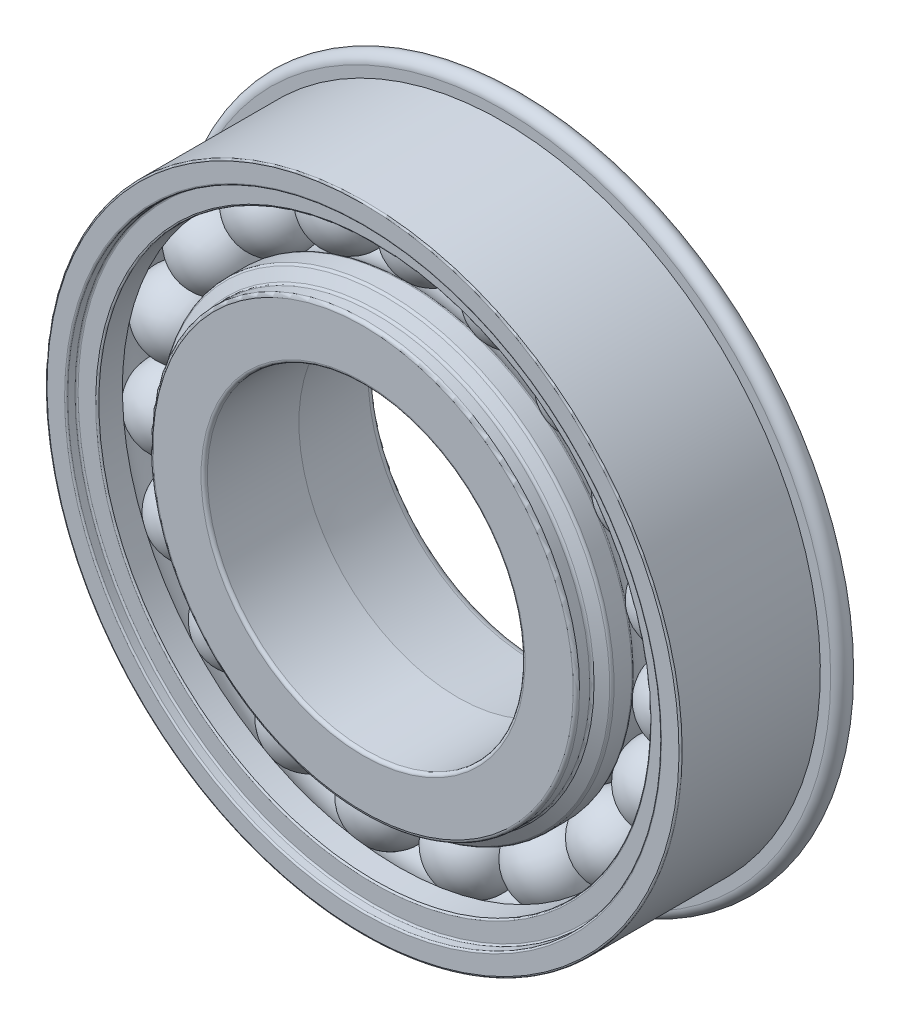
ISO-10303-21;
HEADER;
FILE_DESCRIPTION(('STEP AP214'),'2;1');
FILE_NAME('part.step','',(''),(''),'','','');
FILE_SCHEMA(('AUTOMOTIVE_DESIGN { 1 0 10303 214 1 1 1 1 }'));
ENDSEC;
DATA;
#1=APPLICATION_CONTEXT('core data for automotive mechanical design processes');
#2=APPLICATION_PROTOCOL_DEFINITION('international standard','automotive_design',2000,#1);
#3=PRODUCT_CONTEXT('',#1,'mechanical');
#4=PRODUCT('Part','Part','',(#3));
#5=PRODUCT_RELATED_PRODUCT_CATEGORY('part','',(#4));
#6=PRODUCT_DEFINITION_FORMATION('','',#4);
#7=PRODUCT_DEFINITION_CONTEXT('part definition',#1,'design');
#8=PRODUCT_DEFINITION('design','',#6,#7);
#9=PRODUCT_DEFINITION_SHAPE('','',#8);
#10=(LENGTH_UNIT() NAMED_UNIT(*) SI_UNIT(.MILLI.,.METRE.));
#11=(NAMED_UNIT(*) PLANE_ANGLE_UNIT() SI_UNIT($,.RADIAN.));
#12=(NAMED_UNIT(*) SI_UNIT($,.STERADIAN.) SOLID_ANGLE_UNIT());
#13=UNCERTAINTY_MEASURE_WITH_UNIT(LENGTH_MEASURE(1.E-05),#10,'distance_accuracy_value','');
#14=(GEOMETRIC_REPRESENTATION_CONTEXT(3) GLOBAL_UNCERTAINTY_ASSIGNED_CONTEXT((#13)) GLOBAL_UNIT_ASSIGNED_CONTEXT((#10,
#11,#12)) REPRESENTATION_CONTEXT('',''));
#15=CARTESIAN_POINT('',(0.,0.,0.));
#16=DIRECTION('',(0.,0.,1.));
#17=DIRECTION('',(1.,0.,0.));
#18=AXIS2_PLACEMENT_3D('',#15,#16,#17);
#19=CARTESIAN_POINT('',(-6.65562477986349,19.3871726569314,1.5621));
#20=DIRECTION('',(-0.32469946920467,0.945817241700639,0.));
#21=DIRECTION('',(0.,0.,-1.));
#22=AXIS2_PLACEMENT_3D('',#19,#20,#21);
#23=SPHERICAL_SURFACE('',#22,3.175);
#24=CARTESIAN_POINT('',(-7.68654559458832,22.3901423993309,1.5621));
#25=VERTEX_POINT('',#24);
#26=VERTEX_LOOP('',#25);
#27=FACE_BOUND('',#26,.T.);
#28=ADVANCED_FACE('F42',(#27),#23,.T.);
#29=CLOSED_SHELL('',(#28));
#30=MANIFOLD_SOLID_BREP('B2',#29);
#31=CARTESIAN_POINT('',(-12.5900093421701,16.1756443335056,1.5621));
#32=DIRECTION('',(-0.614212712689658,0.789140509396402,0.));
#33=DIRECTION('',(0.,0.,-1.));
#34=AXIS2_PLACEMENT_3D('',#31,#32,#33);
#35=SPHERICAL_SURFACE('',#34,3.175);
#36=CARTESIAN_POINT('',(-14.5401347049597,18.6811654508391,1.5621));
#37=VERTEX_POINT('',#36);
#38=VERTEX_LOOP('',#37);
#39=FACE_BOUND('',#38,.T.);
#40=ADVANCED_FACE('F59',(#39),#35,.T.);
#41=CLOSED_SHELL('',(#40));
#42=MANIFOLD_SOLID_BREP('B6',#41);
#43=CARTESIAN_POINT('',(-17.1600710381295,11.2112339555621,1.5621));
#44=DIRECTION('',(-0.837166478262522,0.546948158122437,0.));
#45=DIRECTION('',(0.,0.,-1.));
#46=AXIS2_PLACEMENT_3D('',#43,#44,#45);
#47=SPHERICAL_SURFACE('',#46,3.175);
#48=CARTESIAN_POINT('',(-19.818074606613,12.9477943576008,1.5621));
#49=VERTEX_POINT('',#48);
#50=VERTEX_LOOP('',#49);
#51=FACE_BOUND('',#50,.T.);
#52=ADVANCED_FACE('F76',(#51),#47,.T.);
#53=CLOSED_SHELL('',(#52));
#54=MANIFOLD_SOLID_BREP('B38',#53);
#55=CARTESIAN_POINT('',(-19.8705727711711,5.03191241831489,1.5621));
#56=DIRECTION('',(-0.969400265939328,0.24548548714081,0.));
#57=DIRECTION('',(0.,0.,-1.));
#58=AXIS2_PLACEMENT_3D('',#55,#56,#57);
#59=SPHERICAL_SURFACE('',#58,3.175);
#60=CARTESIAN_POINT('',(-22.9484186155285,5.81132883998697,1.5621));
#61=VERTEX_POINT('',#60);
#62=VERTEX_LOOP('',#61);
#63=FACE_BOUND('',#62,.T.);
#64=ADVANCED_FACE('F93',(#63),#59,.T.);
#65=CLOSED_SHELL('',(#64));
#66=MANIFOLD_SOLID_BREP('B55',#65);
#67=CARTESIAN_POINT('',(-20.4277896207521,-1.69269490762256,1.5621));
#68=DIRECTION('',(-0.996584493006671,-0.0825793454723221,0.));
#69=DIRECTION('',(0.,0.,-1.));
#70=AXIS2_PLACEMENT_3D('',#67,#68,#69);
#71=SPHERICAL_SURFACE('',#70,3.175);
#72=CARTESIAN_POINT('',(-23.5919453860483,-1.95488432949719,1.5621));
#73=VERTEX_POINT('',#72);
#74=VERTEX_LOOP('',#73);
#75=FACE_BOUND('',#74,.T.);
#76=ADVANCED_FACE('F110',(#75),#71,.T.);
#77=CLOSED_SHELL('',(#76));
#78=MANIFOLD_SOLID_BREP('B72',#77);
#79=CARTESIAN_POINT('',(-18.7713384951101,-8.23387247545145,1.5621));
#80=DIRECTION('',(-0.915773326655062,-0.40169542465296,0.));
#81=DIRECTION('',(0.,0.,-1.));
#82=AXIS2_PLACEMENT_3D('',#79,#80,#81);
#83=SPHERICAL_SURFACE('',#82,3.175);
#84=CARTESIAN_POINT('',(-21.6789188072399,-9.5092554487246,1.56209999999999));
#85=VERTEX_POINT('',#84);
#86=VERTEX_LOOP('',#85);
#87=FACE_BOUND('',#86,.T.);
#88=ADVANCED_FACE('F127',(#87),#83,.T.);
#89=CLOSED_SHELL('',(#88));
#90=MANIFOLD_SOLID_BREP('B89',#89);
#91=CARTESIAN_POINT('',(-15.0807215761958,-13.88278219887,1.56209999999999));
#92=DIRECTION('',(-0.735723910673138,-0.677281571625734,0.));
#93=DIRECTION('',(0.,0.,-1.));
#94=AXIS2_PLACEMENT_3D('',#91,#92,#93);
#95=SPHERICAL_SURFACE('',#94,3.175);
#96=CARTESIAN_POINT('',(-17.4166449925831,-16.0331511887817,1.56209999999999));
#97=VERTEX_POINT('',#96);
#98=VERTEX_LOOP('',#97);
#99=FACE_BOUND('',#98,.T.);
#100=ADVANCED_FACE('F144',(#99),#95,.T.);
#101=CLOSED_SHELL('',(#100));
#102=MANIFOLD_SOLID_BREP('B106',#101);
#103=CARTESIAN_POINT('',(-9.75587447299548,-18.0272770574803,1.56209999999999));
#104=DIRECTION('',(-0.475947393037081,-0.879473751206485,0.));
#105=DIRECTION('',(0.,0.,-1.));
#106=AXIS2_PLACEMENT_3D('',#103,#104,#105);
#107=SPHERICAL_SURFACE('',#106,3.175);
#108=CARTESIAN_POINT('',(-11.2670074458882,-20.8196062175609,1.56209999999999));
#109=VERTEX_POINT('',#108);
#110=VERTEX_LOOP('',#109);
#111=FACE_BOUND('',#110,.T.);
#112=ADVANCED_FACE('F161',(#111),#107,.T.);
#113=CLOSED_SHELL('',(#112));
#114=MANIFOLD_SOLID_BREP('B123',#113);
#115=CARTESIAN_POINT('',(-3.37382699265658,-20.2182367248883,1.56209999999999));
#116=DIRECTION('',(-0.164594590280741,-0.986361303402721,0.));
#117=DIRECTION('',(0.,0.,-1.));
#118=AXIS2_PLACEMENT_3D('',#115,#116,#117);
#119=SPHERICAL_SURFACE('',#118,3.175);
#120=CARTESIAN_POINT('',(-3.89641481679793,-23.3499338631919,1.56209999999999));
#121=VERTEX_POINT('',#120);
#122=VERTEX_LOOP('',#121);
#123=FACE_BOUND('',#122,.T.);
#124=ADVANCED_FACE('F178',(#123),#119,.T.);
#125=CLOSED_SHELL('',(#124));
#126=MANIFOLD_SOLID_BREP('B140',#125);
#127=CARTESIAN_POINT('',(3.37382699265629,-20.2182367248883,1.56209999999999));
#128=DIRECTION('',(0.164594590280727,-0.986361303402724,0.));
#129=DIRECTION('',(0.,0.,-1.));
#130=AXIS2_PLACEMENT_3D('',#127,#128,#129);
#131=SPHERICAL_SURFACE('',#130,3.175);
#132=CARTESIAN_POINT('',(3.89641481679759,-23.349933863192,1.56209999999999));
#133=VERTEX_POINT('',#132);
#134=VERTEX_LOOP('',#133);
#135=FACE_BOUND('',#134,.T.);
#136=ADVANCED_FACE('F195',(#135),#131,.T.);
#137=CLOSED_SHELL('',(#136));
#138=MANIFOLD_SOLID_BREP('B157',#137);
#139=CARTESIAN_POINT('',(9.75587447299521,-18.0272770574804,1.56209999999999));
#140=DIRECTION('',(0.475947393037068,-0.879473751206492,0.));
#141=DIRECTION('',(0.,0.,-1.));
#142=AXIS2_PLACEMENT_3D('',#139,#140,#141);
#143=SPHERICAL_SURFACE('',#142,3.175);
#144=CARTESIAN_POINT('',(11.2670074458879,-20.819606217561,1.56209999999999));
#145=VERTEX_POINT('',#144);
#146=VERTEX_LOOP('',#145);
#147=FACE_BOUND('',#146,.T.);
#148=ADVANCED_FACE('F212',(#147),#143,.T.);
#149=CLOSED_SHELL('',(#148));
#150=MANIFOLD_SOLID_BREP('B174',#149);
#151=CARTESIAN_POINT('',(15.0807215761956,-13.8827821988702,1.56209999999999));
#152=DIRECTION('',(0.735723910673128,-0.677281571625745,0.));
#153=DIRECTION('',(0.,0.,-1.));
#154=AXIS2_PLACEMENT_3D('',#151,#152,#153);
#155=SPHERICAL_SURFACE('',#154,3.175);
#156=CARTESIAN_POINT('',(17.4166449925828,-16.0331511887819,1.56209999999999));
#157=VERTEX_POINT('',#156);
#158=VERTEX_LOOP('',#157);
#159=FACE_BOUND('',#158,.T.);
#160=ADVANCED_FACE('F229',(#159),#155,.T.);
#161=CLOSED_SHELL('',(#160));
#162=MANIFOLD_SOLID_BREP('B191',#161);
#163=CARTESIAN_POINT('',(18.77133849511,-8.23387247545172,1.5621));
#164=DIRECTION('',(0.915773326655056,-0.401695424652974,0.));
#165=DIRECTION('',(0.,0.,-1.));
#166=AXIS2_PLACEMENT_3D('',#163,#164,#165);
#167=SPHERICAL_SURFACE('',#166,3.175);
#168=CARTESIAN_POINT('',(21.6789188072398,-9.50925544872492,1.56209999999999));
#169=VERTEX_POINT('',#168);
#170=VERTEX_LOOP('',#169);
#171=FACE_BOUND('',#170,.T.);
#172=ADVANCED_FACE('F246',(#171),#167,.T.);
#173=CLOSED_SHELL('',(#172));
#174=MANIFOLD_SOLID_BREP('B208',#173);
#175=CARTESIAN_POINT('',(20.4277896207521,-1.69269490762285,1.5621));
#176=DIRECTION('',(0.99658449300667,-0.082579345472336,0.));
#177=DIRECTION('',(0.,0.,-1.));
#178=AXIS2_PLACEMENT_3D('',#175,#176,#177);
#179=SPHERICAL_SURFACE('',#178,3.175);
#180=CARTESIAN_POINT('',(23.5919453860483,-1.95488432949752,1.5621));
#181=VERTEX_POINT('',#180);
#182=VERTEX_LOOP('',#181);
#183=FACE_BOUND('',#182,.T.);
#184=ADVANCED_FACE('F263',(#183),#179,.T.);
#185=CLOSED_SHELL('',(#184));
#186=MANIFOLD_SOLID_BREP('B225',#185);
#187=CARTESIAN_POINT('',(19.8705727711712,5.03191241831461,1.5621));
#188=DIRECTION('',(0.969400265939331,0.245485487140796,0.));
#189=DIRECTION('',(0.,0.,-1.));
#190=AXIS2_PLACEMENT_3D('',#187,#188,#189);
#191=SPHERICAL_SURFACE('',#190,3.175);
#192=CARTESIAN_POINT('',(22.9484186155286,5.81132883998664,1.5621));
#193=VERTEX_POINT('',#192);
#194=VERTEX_LOOP('',#193);
#195=FACE_BOUND('',#194,.T.);
#196=ADVANCED_FACE('F280',(#195),#191,.T.);
#197=CLOSED_SHELL('',(#196));
#198=MANIFOLD_SOLID_BREP('B242',#197);
#199=CARTESIAN_POINT('',(17.1600710381297,11.2112339555618,1.5621));
#200=DIRECTION('',(0.83716647826253,0.546948158122425,0.));
#201=DIRECTION('',(0.,0.,-1.));
#202=AXIS2_PLACEMENT_3D('',#199,#200,#201);
#203=SPHERICAL_SURFACE('',#202,3.175);
#204=CARTESIAN_POINT('',(19.8180746066132,12.9477943576005,1.5621));
#205=VERTEX_POINT('',#204);
#206=VERTEX_LOOP('',#205);
#207=FACE_BOUND('',#206,.T.);
#208=ADVANCED_FACE('F297',(#207),#203,.T.);
#209=CLOSED_SHELL('',(#208));
#210=MANIFOLD_SOLID_BREP('B259',#209);
#211=CARTESIAN_POINT('',(12.5900093421703,16.1756443335054,1.5621));
#212=DIRECTION('',(0.614212712689669,0.789140509396393,0.));
#213=DIRECTION('',(0.,0.,-1.));
#214=AXIS2_PLACEMENT_3D('',#211,#212,#213);
#215=SPHERICAL_SURFACE('',#214,3.175);
#216=CARTESIAN_POINT('',(14.54013470496,18.6811654508389,1.5621));
#217=VERTEX_POINT('',#216);
#218=VERTEX_LOOP('',#217);
#219=FACE_BOUND('',#218,.T.);
#220=ADVANCED_FACE('F314',(#219),#215,.T.);
#221=CLOSED_SHELL('',(#220));
#222=MANIFOLD_SOLID_BREP('B276',#221);
#223=CARTESIAN_POINT('',(6.65562477986378,19.3871726569313,1.5621));
#224=DIRECTION('',(0.324699469204684,0.945817241700635,0.));
#225=DIRECTION('',(0.,0.,-1.));
#226=AXIS2_PLACEMENT_3D('',#223,#224,#225);
#227=SPHERICAL_SURFACE('',#226,3.175);
#228=CARTESIAN_POINT('',(7.68654559458865,22.3901423993308,1.5621));
#229=VERTEX_POINT('',#228);
#230=VERTEX_LOOP('',#229);
#231=FACE_BOUND('',#230,.T.);
#232=ADVANCED_FACE('F331',(#231),#227,.T.);
#233=CLOSED_SHELL('',(#232));
#234=MANIFOLD_SOLID_BREP('B293',#233);
#235=CARTESIAN_POINT('',(0.,20.4978,1.5621));
#236=DIRECTION('',(0.,1.,0.));
#237=DIRECTION('',(0.,0.,-1.));
#238=AXIS2_PLACEMENT_3D('',#235,#236,#237);
#239=SPHERICAL_SURFACE('',#238,3.175);
#240=CARTESIAN_POINT('',(0.,23.6728,1.5621));
#241=VERTEX_POINT('',#240);
#242=VERTEX_LOOP('',#241);
#243=FACE_BOUND('',#242,.T.);
#244=ADVANCED_FACE('F350',(#243),#239,.T.);
#245=CLOSED_SHELL('',(#244));
#246=MANIFOLD_SOLID_BREP('B310',#245);
#247=CARTESIAN_POINT('',(0.,17.0688,-7.1501));
#248=DIRECTION('',(0.,0.,1.));
#249=DIRECTION('',(0.,-1.,0.));
#250=AXIS2_PLACEMENT_3D('',#247,#248,#249);
#251=PLANE('',#250);
#252=CARTESIAN_POINT('',(0.,0.,-7.1501));
#253=DIRECTION('',(0.,0.,1.));
#254=DIRECTION('',(0.,-1.,0.));
#255=AXIS2_PLACEMENT_3D('',#252,#253,#254);
#256=CIRCLE('',#255,15.7226);
#257=CARTESIAN_POINT('',(0.,-15.7226,-7.15010000000001));
#258=VERTEX_POINT('',#257);
#259=EDGE_CURVE('E349',#258,#258,#256,.F.);
#260=ORIENTED_EDGE('',*,*,#259,.T.);
#261=EDGE_LOOP('',(#260));
#262=FACE_BOUND('',#261,.T.);
#263=CARTESIAN_POINT('',(0.,0.,-7.1501));
#264=DIRECTION('',(0.,0.,1.));
#265=DIRECTION('',(0.,-1.,0.));
#266=AXIS2_PLACEMENT_3D('',#263,#264,#265);
#267=CIRCLE('',#266,14.5430538592672);
#268=CARTESIAN_POINT('',(0.,-14.5430538592672,-7.15010000000001));
#269=VERTEX_POINT('',#268);
#270=EDGE_CURVE('E430',#269,#269,#267,.T.);
#271=ORIENTED_EDGE('',*,*,#270,.T.);
#272=EDGE_LOOP('',(#271));
#273=FACE_BOUND('',#272,.T.);
#274=ADVANCED_FACE('F368',(#262,#273),#251,.F.);
#275=CARTESIAN_POINT('',(0.,0.,7.1501));
#276=DIRECTION('',(0.,0.,1.));
#277=DIRECTION('',(0.,-1.,0.));
#278=AXIS2_PLACEMENT_3D('',#275,#276,#277);
#279=CYLINDRICAL_SURFACE('',#278,17.0688);
#280=CARTESIAN_POINT('',(0.,0.,-6.53203333333334));
#281=DIRECTION('',(0.,0.,-1.));
#282=DIRECTION('',(0.,1.,0.));
#283=AXIS2_PLACEMENT_3D('',#280,#281,#282);
#284=CIRCLE('',#283,17.0688);
#285=CARTESIAN_POINT('',(0.,17.0688,-6.53203333333333));
#286=VERTEX_POINT('',#285);
#287=EDGE_CURVE('E424',#286,#286,#284,.F.);
#288=ORIENTED_EDGE('',*,*,#287,.T.);
#289=EDGE_LOOP('',(#288));
#290=FACE_BOUND('',#289,.T.);
#291=CARTESIAN_POINT('',(0.,0.,-4.17254696837416));
#292=DIRECTION('',(0.,0.,1.));
#293=DIRECTION('',(0.,-1.,0.));
#294=AXIS2_PLACEMENT_3D('',#291,#292,#293);
#295=CIRCLE('',#294,17.0688);
#296=CARTESIAN_POINT('',(0.,-17.0688,-4.17254696837417));
#297=VERTEX_POINT('',#296);
#298=EDGE_CURVE('E427',#297,#297,#295,.F.);
#299=ORIENTED_EDGE('',*,*,#298,.T.);
#300=EDGE_LOOP('',(#299));
#301=FACE_BOUND('',#300,.T.);
#302=ADVANCED_FACE('F486',(#290,#301),#279,.T.);
#303=CARTESIAN_POINT('',(0.,0.,7.1501));
#304=DIRECTION('',(0.,0.,1.));
#305=DIRECTION('',(0.,-1.,0.));
#306=AXIS2_PLACEMENT_3D('',#303,#304,#305);
#307=CYLINDRICAL_SURFACE('',#306,12.7);
#308=CARTESIAN_POINT('',(0.,0.,6.8961));
#309=DIRECTION('',(0.,0.,-1.));
#310=DIRECTION('',(0.,1.,0.));
#311=AXIS2_PLACEMENT_3D('',#308,#309,#310);
#312=CIRCLE('',#311,12.7);
#313=CARTESIAN_POINT('',(0.,12.7,6.8961));
#314=VERTEX_POINT('',#313);
#315=EDGE_CURVE('E379',#314,#314,#312,.F.);
#316=ORIENTED_EDGE('',*,*,#315,.T.);
#317=EDGE_LOOP('',(#316));
#318=FACE_BOUND('',#317,.T.);
#319=CARTESIAN_POINT('',(0.,0.,-0.418894688967742));
#320=DIRECTION('',(0.,0.,1.));
#321=DIRECTION('',(0.,-1.,0.));
#322=AXIS2_PLACEMENT_3D('',#319,#320,#321);
#323=CIRCLE('',#322,12.7);
#324=CARTESIAN_POINT('',(0.,-12.7,-0.418894688967744));
#325=VERTEX_POINT('',#324);
#326=EDGE_CURVE('E436',#325,#325,#323,.T.);
#327=ORIENTED_EDGE('',*,*,#326,.F.);
#328=EDGE_LOOP('',(#327));
#329=FACE_BOUND('',#328,.T.);
#330=ADVANCED_FACE('F491',(#318,#329),#307,.F.);
#331=CARTESIAN_POINT('',(0.,12.7,7.1501));
#332=DIRECTION('',(0.,0.,-1.));
#333=DIRECTION('',(0.,1.,0.));
#334=AXIS2_PLACEMENT_3D('',#331,#332,#333);
#335=PLANE('',#334);
#336=CARTESIAN_POINT('',(0.,0.,7.1501));
#337=DIRECTION('',(0.,0.,-1.));
#338=DIRECTION('',(0.,1.,0.));
#339=AXIS2_PLACEMENT_3D('',#336,#337,#338);
#340=CIRCLE('',#339,16.8148);
#341=CARTESIAN_POINT('',(0.,16.8148,7.1501));
#342=VERTEX_POINT('',#341);
#343=EDGE_CURVE('E383',#342,#342,#340,.F.);
#344=ORIENTED_EDGE('',*,*,#343,.T.);
#345=EDGE_LOOP('',(#344));
#346=FACE_BOUND('',#345,.T.);
#347=CARTESIAN_POINT('',(0.,0.,7.1501));
#348=DIRECTION('',(0.,0.,-1.));
#349=DIRECTION('',(0.,1.,0.));
#350=AXIS2_PLACEMENT_3D('',#347,#348,#349);
#351=CIRCLE('',#350,12.954);
#352=CARTESIAN_POINT('',(0.,12.954,7.1501));
#353=VERTEX_POINT('',#352);
#354=EDGE_CURVE('E388',#353,#353,#351,.T.);
#355=ORIENTED_EDGE('',*,*,#354,.T.);
#356=EDGE_LOOP('',(#355));
#357=FACE_BOUND('',#356,.T.);
#358=ADVANCED_FACE('F499',(#346,#357),#335,.F.);
#359=CARTESIAN_POINT('',(0.,0.,-4.0259));
#360=DIRECTION('',(0.,0.,1.));
#361=DIRECTION('',(0.,-1.,0.));
#362=AXIS2_PLACEMENT_3D('',#359,#360,#361);
#363=CONICAL_SURFACE('',#362,17.0688,1.0471975511966);
#364=CARTESIAN_POINT('',(0.,0.,-3.95257651581292));
#365=DIRECTION('',(0.,0.,1.));
#366=DIRECTION('',(0.,-1.,0.));
#367=AXIS2_PLACEMENT_3D('',#364,#365,#366);
#368=CIRCLE('',#367,17.1958);
#369=CARTESIAN_POINT('',(0.,-17.1958,-3.95257651581292));
#370=VERTEX_POINT('',#369);
#371=EDGE_CURVE('E418',#370,#370,#368,.T.);
#372=ORIENTED_EDGE('',*,*,#371,.T.);
#373=EDGE_LOOP('',(#372));
#374=FACE_BOUND('',#373,.T.);
#375=CARTESIAN_POINT('',(0.,0.,-3.42098125545658));
#376=DIRECTION('',(0.,0.,1.));
#377=DIRECTION('',(0.,-1.,0.));
#378=AXIS2_PLACEMENT_3D('',#375,#376,#377);
#379=CIRCLE('',#378,18.11655);
#380=CARTESIAN_POINT('',(0.,-18.11655,-3.42098125545658));
#381=VERTEX_POINT('',#380);
#382=EDGE_CURVE('E433',#381,#381,#379,.T.);
#383=ORIENTED_EDGE('',*,*,#382,.F.);
#384=EDGE_LOOP('',(#383));
#385=FACE_BOUND('',#384,.T.);
#386=ADVANCED_FACE('F502',(#374,#385),#363,.T.);
#387=CARTESIAN_POINT('',(0.,0.,7.1501));
#388=DIRECTION('',(0.,0.,1.));
#389=DIRECTION('',(0.,-1.,0.));
#390=AXIS2_PLACEMENT_3D('',#387,#388,#389);
#391=CYLINDRICAL_SURFACE('',#390,18.11655);
#392=CARTESIAN_POINT('',(0.,0.,-0.631868650072287));
#393=DIRECTION('',(0.,0.,-1.));
#394=DIRECTION('',(0.,1.,0.));
#395=AXIS2_PLACEMENT_3D('',#392,#393,#394);
#396=CIRCLE('',#395,18.11655);
#397=CARTESIAN_POINT('',(0.,18.11655,-0.631868650072283));
#398=VERTEX_POINT('',#397);
#399=EDGE_CURVE('E409',#398,#398,#396,.T.);
#400=ORIENTED_EDGE('',*,*,#399,.T.);
#401=EDGE_LOOP('',(#400));
#402=FACE_BOUND('',#401,.T.);
#403=ORIENTED_EDGE('',*,*,#382,.T.);
#404=EDGE_LOOP('',(#403));
#405=FACE_BOUND('',#404,.T.);
#406=ADVANCED_FACE('F608',(#402,#405),#391,.T.);
#407=CARTESIAN_POINT('',(0.,0.,1.5621));
#408=DIRECTION('',(0.,0.,1.));
#409=DIRECTION('',(0.,-1.,0.));
#410=AXIS2_PLACEMENT_3D('',#407,#408,#409);
#411=TOROIDAL_SURFACE('',#410,20.4978,3.175);
#412=CARTESIAN_POINT('',(0.,0.,-0.469352453770624));
#413=DIRECTION('',(0.,0.,1.));
#414=DIRECTION('',(0.,-1.,0.));
#415=AXIS2_PLACEMENT_3D('',#412,#413,#414);
#416=CIRCLE('',#415,18.0577537037037);
#417=CARTESIAN_POINT('',(0.,-18.0577537037037,-0.469352453770627));
#418=VERTEX_POINT('',#417);
#419=EDGE_CURVE('E412',#418,#418,#416,.T.);
#420=ORIENTED_EDGE('',*,*,#419,.T.);
#421=EDGE_LOOP('',(#420));
#422=FACE_BOUND('',#421,.T.);
#423=CARTESIAN_POINT('',(0.,0.,3.59355245377062));
#424=DIRECTION('',(0.,0.,-1.));
#425=DIRECTION('',(0.,1.,0.));
#426=AXIS2_PLACEMENT_3D('',#423,#424,#425);
#427=CIRCLE('',#426,18.0577537037037);
#428=CARTESIAN_POINT('',(0.,18.0577537037037,3.59355245377062));
#429=VERTEX_POINT('',#428);
#430=EDGE_CURVE('E415',#429,#429,#427,.T.);
#431=ORIENTED_EDGE('',*,*,#430,.T.);
#432=EDGE_LOOP('',(#431));
#433=FACE_BOUND('',#432,.T.);
#434=ADVANCED_FACE('F604',(#422,#433),#411,.F.);
#435=CARTESIAN_POINT('',(0.,0.,7.1501));
#436=DIRECTION('',(0.,0.,1.));
#437=DIRECTION('',(0.,-1.,0.));
#438=AXIS2_PLACEMENT_3D('',#435,#436,#437);
#439=CYLINDRICAL_SURFACE('',#438,18.11655);
#440=CARTESIAN_POINT('',(0.,0.,3.75606865007228));
#441=DIRECTION('',(0.,0.,-1.));
#442=DIRECTION('',(0.,1.,0.));
#443=AXIS2_PLACEMENT_3D('',#440,#441,#442);
#444=CIRCLE('',#443,18.11655);
#445=CARTESIAN_POINT('',(0.,18.11655,3.75606865007228));
#446=VERTEX_POINT('',#445);
#447=EDGE_CURVE('E403',#446,#446,#444,.F.);
#448=ORIENTED_EDGE('',*,*,#447,.T.);
#449=EDGE_LOOP('',(#448));
#450=FACE_BOUND('',#449,.T.);
#451=CARTESIAN_POINT('',(0.,0.,5.18869679799555));
#452=DIRECTION('',(0.,0.,-1.));
#453=DIRECTION('',(0.,1.,0.));
#454=AXIS2_PLACEMENT_3D('',#451,#452,#453);
#455=CIRCLE('',#454,18.11655);
#456=CARTESIAN_POINT('',(0.,18.11655,5.18869679799556));
#457=VERTEX_POINT('',#456);
#458=EDGE_CURVE('E406',#457,#457,#455,.T.);
#459=ORIENTED_EDGE('',*,*,#458,.T.);
#460=EDGE_LOOP('',(#459));
#461=FACE_BOUND('',#460,.T.);
#462=ADVANCED_FACE('F600',(#450,#461),#439,.T.);
#463=CARTESIAN_POINT('',(0.,0.,5.33534376636972));
#464=DIRECTION('',(0.,0.,-1.));
#465=DIRECTION('',(0.,1.,0.));
#466=AXIS2_PLACEMENT_3D('',#463,#464,#465);
#467=CONICAL_SURFACE('',#466,18.11655,1.0471975511966);
#468=CARTESIAN_POINT('',(0.,0.,5.4086672505568));
#469=DIRECTION('',(0.,0.,1.));
#470=DIRECTION('',(0.,-1.,0.));
#471=AXIS2_PLACEMENT_3D('',#468,#469,#470);
#472=CIRCLE('',#471,17.98955);
#473=CARTESIAN_POINT('',(0.,-17.98955,5.4086672505568));
#474=VERTEX_POINT('',#473);
#475=EDGE_CURVE('E397',#474,#474,#472,.T.);
#476=ORIENTED_EDGE('',*,*,#475,.T.);
#477=EDGE_LOOP('',(#476));
#478=FACE_BOUND('',#477,.T.);
#479=CARTESIAN_POINT('',(0.,0.,5.86693902672606));
#480=DIRECTION('',(0.,0.,-1.));
#481=DIRECTION('',(0.,1.,0.));
#482=AXIS2_PLACEMENT_3D('',#479,#480,#481);
#483=CIRCLE('',#482,17.1958);
#484=CARTESIAN_POINT('',(0.,17.1958,5.86693902672606));
#485=VERTEX_POINT('',#484);
#486=EDGE_CURVE('E400',#485,#485,#483,.T.);
#487=ORIENTED_EDGE('',*,*,#486,.T.);
#488=EDGE_LOOP('',(#487));
#489=FACE_BOUND('',#488,.T.);
#490=ADVANCED_FACE('F596',(#478,#489),#467,.T.);
#491=CARTESIAN_POINT('',(0.,0.,7.1501));
#492=DIRECTION('',(0.,0.,1.));
#493=DIRECTION('',(0.,-1.,0.));
#494=AXIS2_PLACEMENT_3D('',#491,#492,#493);
#495=CYLINDRICAL_SURFACE('',#494,17.0688);
#496=CARTESIAN_POINT('',(0.,0.,6.08690947928731));
#497=DIRECTION('',(0.,0.,1.));
#498=DIRECTION('',(0.,-1.,0.));
#499=AXIS2_PLACEMENT_3D('',#496,#497,#498);
#500=CIRCLE('',#499,17.0688);
#501=CARTESIAN_POINT('',(0.,-17.0688,6.0869094792873));
#502=VERTEX_POINT('',#501);
#503=EDGE_CURVE('E391',#502,#502,#500,.T.);
#504=ORIENTED_EDGE('',*,*,#503,.T.);
#505=EDGE_LOOP('',(#504));
#506=FACE_BOUND('',#505,.T.);
#507=CARTESIAN_POINT('',(0.,0.,6.8961));
#508=DIRECTION('',(0.,0.,-1.));
#509=DIRECTION('',(0.,1.,0.));
#510=AXIS2_PLACEMENT_3D('',#507,#508,#509);
#511=CIRCLE('',#510,17.0688);
#512=CARTESIAN_POINT('',(0.,17.0688,6.8961));
#513=VERTEX_POINT('',#512);
#514=EDGE_CURVE('E394',#513,#513,#511,.T.);
#515=ORIENTED_EDGE('',*,*,#514,.T.);
#516=EDGE_LOOP('',(#515));
#517=FACE_BOUND('',#516,.T.);
#518=ADVANCED_FACE('F554',(#506,#517),#495,.T.);
#519=CARTESIAN_POINT('',(0.,0.,-6.41406452036773));
#520=DIRECTION('',(0.,0.,1.));
#521=DIRECTION('',(0.,-1.,0.));
#522=AXIS2_PLACEMENT_3D('',#519,#520,#521);
#523=TOROIDAL_SURFACE('',#522,13.9894201123681,0.762);
#524=CARTESIAN_POINT('',(0.,0.,-6.48047719634144));
#525=DIRECTION('',(0.,0.,1.));
#526=DIRECTION('',(0.,-1.,0.));
#527=AXIS2_PLACEMENT_3D('',#524,#525,#526);
#528=CIRCLE('',#527,13.2303197524222);
#529=CARTESIAN_POINT('',(0.,-13.2303197524222,-6.48047719634144));
#530=VERTEX_POINT('',#529);
#531=EDGE_CURVE('E439',#530,#530,#528,.T.);
#532=ORIENTED_EDGE('',*,*,#531,.T.);
#533=EDGE_LOOP('',(#532));
#534=FACE_BOUND('',#533,.T.);
#535=CARTESIAN_POINT('',(0.,0.,-7.1501));
#536=DIRECTION('',(0.,0.,1.));
#537=DIRECTION('',(0.,-1.,0.));
#538=AXIS2_PLACEMENT_3D('',#535,#536,#537);
#539=CIRCLE('',#538,13.7922);
#540=CARTESIAN_POINT('',(0.,-13.7922,-7.15010000000001));
#541=VERTEX_POINT('',#540);
#542=EDGE_CURVE('E457',#541,#541,#539,.T.);
#543=ORIENTED_EDGE('',*,*,#542,.F.);
#544=EDGE_LOOP('',(#543));
#545=FACE_BOUND('',#544,.T.);
#546=ADVANCED_FACE('F548',(#534,#545),#523,.T.);
#547=CARTESIAN_POINT('',(0.,0.,-6.48047719634144));
#548=DIRECTION('',(0.,0.,-1.));
#549=DIRECTION('',(0.,1.,0.));
#550=AXIS2_PLACEMENT_3D('',#547,#548,#549);
#551=CONICAL_SURFACE('',#550,13.2303197524222,0.0872664625997096);
#552=ORIENTED_EDGE('',*,*,#326,.T.);
#553=EDGE_LOOP('',(#552));
#554=FACE_BOUND('',#553,.T.);
#555=ORIENTED_EDGE('',*,*,#531,.F.);
#556=EDGE_LOOP('',(#555));
#557=FACE_BOUND('',#556,.T.);
#558=ADVANCED_FACE('F544',(#554,#557),#551,.F.);
#559=CARTESIAN_POINT('',(0.,0.,-6.41406452036773));
#560=DIRECTION('',(0.,0.,1.));
#561=DIRECTION('',(0.,-1.,0.));
#562=AXIS2_PLACEMENT_3D('',#559,#560,#561);
#563=TOROIDAL_SURFACE('',#562,13.9894201123681,0.507999999999999);
#564=CARTESIAN_POINT('',(0.,0.,-6.90475484012258));
#565=DIRECTION('',(0.,0.,1.));
#566=DIRECTION('',(0.,-1.,0.));
#567=AXIS2_PLACEMENT_3D('',#564,#565,#566);
#568=CIRCLE('',#567,13.857940037456);
#569=CARTESIAN_POINT('',(0.,-13.857940037456,-6.90475484012258));
#570=VERTEX_POINT('',#569);
#571=EDGE_CURVE('E460',#570,#570,#568,.T.);
#572=ORIENTED_EDGE('',*,*,#571,.T.);
#573=EDGE_LOOP('',(#572));
#574=FACE_BOUND('',#573,.T.);
#575=CARTESIAN_POINT('',(0.,0.,-6.45833963768354));
#576=DIRECTION('',(0.,0.,1.));
#577=DIRECTION('',(0.,-1.,0.));
#578=AXIS2_PLACEMENT_3D('',#575,#576,#577);
#579=CIRCLE('',#578,13.4833532057375);
#580=CARTESIAN_POINT('',(0.,-13.4833532057375,-6.45833963768354));
#581=VERTEX_POINT('',#580);
#582=EDGE_CURVE('E442',#581,#581,#579,.T.);
#583=ORIENTED_EDGE('',*,*,#582,.F.);
#584=EDGE_LOOP('',(#583));
#585=FACE_BOUND('',#584,.T.);
#586=ADVANCED_FACE('F547',(#574,#585),#563,.F.);
#587=CARTESIAN_POINT('',(0.,0.,-5.5499));
#588=DIRECTION('',(0.,0.,-1.));
#589=DIRECTION('',(0.,1.,0.));
#590=AXIS2_PLACEMENT_3D('',#587,#588,#589);
#591=CONICAL_SURFACE('',#590,13.4038750359426,0.0872664625997097);
#592=ORIENTED_EDGE('',*,*,#582,.T.);
#593=EDGE_LOOP('',(#592));
#594=FACE_BOUND('',#593,.T.);
#595=CARTESIAN_POINT('',(0.,0.,-5.5499));
#596=DIRECTION('',(0.,0.,1.));
#597=DIRECTION('',(0.,-1.,0.));
#598=AXIS2_PLACEMENT_3D('',#595,#596,#597);
#599=CIRCLE('',#598,13.4038750359426);
#600=CARTESIAN_POINT('',(0.,-13.4038750359426,-5.5499));
#601=VERTEX_POINT('',#600);
#602=EDGE_CURVE('E445',#601,#601,#599,.T.);
#603=ORIENTED_EDGE('',*,*,#602,.F.);
#604=EDGE_LOOP('',(#603));
#605=FACE_BOUND('',#604,.T.);
#606=ADVANCED_FACE('F565',(#594,#605),#591,.T.);
#607=CARTESIAN_POINT('',(0.,13.4038750359426,-5.5499));
#608=DIRECTION('',(0.,0.,-1.));
#609=DIRECTION('',(0.,1.,0.));
#610=AXIS2_PLACEMENT_3D('',#607,#608,#609);
#611=PLANE('',#610);
#612=ORIENTED_EDGE('',*,*,#602,.T.);
#613=EDGE_LOOP('',(#612));
#614=FACE_BOUND('',#613,.T.);
#615=CARTESIAN_POINT('',(0.,0.,-5.5499));
#616=DIRECTION('',(0.,0.,1.));
#617=DIRECTION('',(0.,-1.,0.));
#618=AXIS2_PLACEMENT_3D('',#615,#616,#617);
#619=CIRCLE('',#618,13.5313601553106);
#620=CARTESIAN_POINT('',(0.,-13.5313601553106,-5.5499));
#621=VERTEX_POINT('',#620);
#622=EDGE_CURVE('E448',#621,#621,#619,.T.);
#623=ORIENTED_EDGE('',*,*,#622,.F.);
#624=EDGE_LOOP('',(#623));
#625=FACE_BOUND('',#624,.T.);
#626=ADVANCED_FACE('F571',(#614,#625),#611,.T.);
#627=CARTESIAN_POINT('',(0.,0.,-6.44727085835459));
#628=DIRECTION('',(0.,0.,-1.));
#629=DIRECTION('',(0.,1.,0.));
#630=AXIS2_PLACEMENT_3D('',#627,#628,#629);
#631=CONICAL_SURFACE('',#630,13.6098699323952,0.0872664625997107);
#632=ORIENTED_EDGE('',*,*,#622,.T.);
#633=EDGE_LOOP('',(#632));
#634=FACE_BOUND('',#633,.T.);
#635=CARTESIAN_POINT('',(0.,0.,-6.44727085835459));
#636=DIRECTION('',(0.,0.,1.));
#637=DIRECTION('',(0.,-1.,0.));
#638=AXIS2_PLACEMENT_3D('',#635,#636,#637);
#639=CIRCLE('',#638,13.6098699323952);
#640=CARTESIAN_POINT('',(0.,-13.6098699323952,-6.44727085835459));
#641=VERTEX_POINT('',#640);
#642=EDGE_CURVE('E451',#641,#641,#639,.T.);
#643=ORIENTED_EDGE('',*,*,#642,.F.);
#644=EDGE_LOOP('',(#643));
#645=FACE_BOUND('',#644,.T.);
#646=ADVANCED_FACE('F577',(#634,#645),#631,.F.);
#647=CARTESIAN_POINT('',(0.,0.,-6.41406452036773));
#648=DIRECTION('',(0.,0.,1.));
#649=DIRECTION('',(0.,-1.,0.));
#650=AXIS2_PLACEMENT_3D('',#647,#648,#649);
#651=TOROIDAL_SURFACE('',#650,13.9894201123681,0.380999999999996);
#652=ORIENTED_EDGE('',*,*,#642,.T.);
#653=EDGE_LOOP('',(#652));
#654=FACE_BOUND('',#653,.T.);
#655=CARTESIAN_POINT('',(0.,0.,-6.78208226018386));
#656=DIRECTION('',(0.,0.,1.));
#657=DIRECTION('',(0.,-1.,0.));
#658=AXIS2_PLACEMENT_3D('',#655,#656,#657);
#659=CIRCLE('',#658,13.8908100561841);
#660=CARTESIAN_POINT('',(0.,-13.8908100561841,-6.78208226018387));
#661=VERTEX_POINT('',#660);
#662=EDGE_CURVE('E454',#661,#661,#659,.T.);
#663=ORIENTED_EDGE('',*,*,#662,.F.);
#664=EDGE_LOOP('',(#663));
#665=FACE_BOUND('',#664,.T.);
#666=ADVANCED_FACE('F560',(#654,#665),#651,.T.);
#667=CARTESIAN_POINT('',(0.,0.,-6.90475484012258));
#668=DIRECTION('',(0.,0.,1.));
#669=DIRECTION('',(0.,-1.,0.));
#670=AXIS2_PLACEMENT_3D('',#667,#668,#669);
#671=CONICAL_SURFACE('',#670,13.857940037456,0.26179938779914);
#672=ORIENTED_EDGE('',*,*,#542,.T.);
#673=EDGE_LOOP('',(#672));
#674=FACE_BOUND('',#673,.T.);
#675=ORIENTED_EDGE('',*,*,#571,.F.);
#676=EDGE_LOOP('',(#675));
#677=FACE_BOUND('',#676,.T.);
#678=ADVANCED_FACE('F481',(#674,#677),#671,.T.);
#679=CARTESIAN_POINT('',(0.,0.,-6.3881));
#680=DIRECTION('',(0.,0.,1.));
#681=DIRECTION('',(0.,-1.,0.));
#682=AXIS2_PLACEMENT_3D('',#679,#680,#681);
#683=TOROIDAL_SURFACE('',#682,14.5430538592672,0.762);
#684=ORIENTED_EDGE('',*,*,#662,.T.);
#685=EDGE_LOOP('',(#684));
#686=FACE_BOUND('',#685,.T.);
#687=ORIENTED_EDGE('',*,*,#270,.F.);
#688=EDGE_LOOP('',(#687));
#689=FACE_BOUND('',#688,.T.);
#690=ADVANCED_FACE('F471',(#686,#689),#683,.T.);
#691=CARTESIAN_POINT('',(0.,0.,7.1501));
#692=DIRECTION('',(0.,0.,1.));
#693=DIRECTION('',(0.,-1.,0.));
#694=AXIS2_PLACEMENT_3D('',#691,#692,#693);
#695=CYLINDRICAL_SURFACE('',#694,15.9766);
#696=CARTESIAN_POINT('',(0.,0.,-6.8961));
#697=DIRECTION('',(0.,0.,1.));
#698=DIRECTION('',(0.,-1.,0.));
#699=AXIS2_PLACEMENT_3D('',#696,#697,#698);
#700=CIRCLE('',#699,15.9766);
#701=CARTESIAN_POINT('',(0.,-15.9766,-6.89610000000001));
#702=VERTEX_POINT('',#701);
#703=EDGE_CURVE('E375',#702,#702,#700,.T.);
#704=ORIENTED_EDGE('',*,*,#703,.T.);
#705=EDGE_LOOP('',(#704));
#706=FACE_BOUND('',#705,.T.);
#707=CARTESIAN_POINT('',(0.,0.,-6.78603333333334));
#708=DIRECTION('',(0.,0.,1.));
#709=DIRECTION('',(0.,-1.,0.));
#710=AXIS2_PLACEMENT_3D('',#707,#708,#709);
#711=CIRCLE('',#710,15.9766);
#712=CARTESIAN_POINT('',(0.,-15.9766,-6.78603333333334));
#713=VERTEX_POINT('',#712);
#714=EDGE_CURVE('E463',#713,#713,#711,.T.);
#715=ORIENTED_EDGE('',*,*,#714,.F.);
#716=EDGE_LOOP('',(#715));
#717=FACE_BOUND('',#716,.T.);
#718=ADVANCED_FACE('F469',(#706,#717),#695,.T.);
#719=CARTESIAN_POINT('',(0.,16.3406666666667,-6.78603333333333));
#720=DIRECTION('',(0.,0.,-1.));
#721=DIRECTION('',(0.,1.,0.));
#722=AXIS2_PLACEMENT_3D('',#719,#720,#721);
#723=PLANE('',#722);
#724=CARTESIAN_POINT('',(0.,0.,-6.78603333333334));
#725=DIRECTION('',(0.,0.,-1.));
#726=DIRECTION('',(0.,1.,0.));
#727=AXIS2_PLACEMENT_3D('',#724,#725,#726);
#728=CIRCLE('',#727,16.8148);
#729=CARTESIAN_POINT('',(0.,16.8148,-6.78603333333333));
#730=VERTEX_POINT('',#729);
#731=EDGE_CURVE('E421',#730,#730,#728,.T.);
#732=ORIENTED_EDGE('',*,*,#731,.T.);
#733=EDGE_LOOP('',(#732));
#734=FACE_BOUND('',#733,.T.);
#735=ORIENTED_EDGE('',*,*,#714,.T.);
#736=EDGE_LOOP('',(#735));
#737=FACE_BOUND('',#736,.T.);
#738=ADVANCED_FACE('F467',(#734,#737),#723,.T.);
#739=CARTESIAN_POINT('',(0.,0.,-6.53203333333334));
#740=DIRECTION('',(0.,0.,-1.));
#741=DIRECTION('',(0.,1.,0.));
#742=AXIS2_PLACEMENT_3D('',#739,#740,#741);
#743=TOROIDAL_SURFACE('',#742,16.8148,0.254);
#744=ORIENTED_EDGE('',*,*,#731,.F.);
#745=EDGE_LOOP('',(#744));
#746=FACE_BOUND('',#745,.T.);
#747=ORIENTED_EDGE('',*,*,#287,.F.);
#748=EDGE_LOOP('',(#747));
#749=FACE_BOUND('',#748,.T.);
#750=ADVANCED_FACE('F477',(#746,#749),#743,.T.);
#751=CARTESIAN_POINT('',(0.,0.,-4.17254696837416));
#752=DIRECTION('',(0.,0.,1.));
#753=DIRECTION('',(0.,-1.,0.));
#754=AXIS2_PLACEMENT_3D('',#751,#752,#753);
#755=TOROIDAL_SURFACE('',#754,17.3228,0.254);
#756=ORIENTED_EDGE('',*,*,#298,.F.);
#757=EDGE_LOOP('',(#756));
#758=FACE_BOUND('',#757,.T.);
#759=ORIENTED_EDGE('',*,*,#371,.F.);
#760=EDGE_LOOP('',(#759));
#761=FACE_BOUND('',#760,.T.);
#762=ADVANCED_FACE('F507',(#758,#761),#755,.F.);
#763=CARTESIAN_POINT('',(0.,0.,-0.631868650072287));
#764=DIRECTION('',(0.,0.,-1.));
#765=DIRECTION('',(0.,1.,0.));
#766=AXIS2_PLACEMENT_3D('',#763,#764,#765);
#767=TOROIDAL_SURFACE('',#766,17.86255,0.254);
#768=ORIENTED_EDGE('',*,*,#399,.F.);
#769=EDGE_LOOP('',(#768));
#770=FACE_BOUND('',#769,.T.);
#771=ORIENTED_EDGE('',*,*,#419,.F.);
#772=EDGE_LOOP('',(#771));
#773=FACE_BOUND('',#772,.T.);
#774=ADVANCED_FACE('F511',(#770,#773),#767,.T.);
#775=CARTESIAN_POINT('',(0.,0.,3.75606865007228));
#776=DIRECTION('',(0.,0.,-1.));
#777=DIRECTION('',(0.,1.,0.));
#778=AXIS2_PLACEMENT_3D('',#775,#776,#777);
#779=TOROIDAL_SURFACE('',#778,17.86255,0.254);
#780=ORIENTED_EDGE('',*,*,#430,.F.);
#781=EDGE_LOOP('',(#780));
#782=FACE_BOUND('',#781,.T.);
#783=ORIENTED_EDGE('',*,*,#447,.F.);
#784=EDGE_LOOP('',(#783));
#785=FACE_BOUND('',#784,.T.);
#786=ADVANCED_FACE('F515',(#782,#785),#779,.T.);
#787=CARTESIAN_POINT('',(0.,0.,5.18869679799555));
#788=DIRECTION('',(0.,0.,-1.));
#789=DIRECTION('',(0.,1.,0.));
#790=AXIS2_PLACEMENT_3D('',#787,#788,#789);
#791=TOROIDAL_SURFACE('',#790,17.86255,0.254);
#792=ORIENTED_EDGE('',*,*,#458,.F.);
#793=EDGE_LOOP('',(#792));
#794=FACE_BOUND('',#793,.T.);
#795=ORIENTED_EDGE('',*,*,#475,.F.);
#796=EDGE_LOOP('',(#795));
#797=FACE_BOUND('',#796,.T.);
#798=ADVANCED_FACE('F519',(#794,#797),#791,.T.);
#799=CARTESIAN_POINT('',(0.,0.,6.08690947928731));
#800=DIRECTION('',(0.,0.,1.));
#801=DIRECTION('',(0.,-1.,0.));
#802=AXIS2_PLACEMENT_3D('',#799,#800,#801);
#803=TOROIDAL_SURFACE('',#802,17.3228,0.254);
#804=ORIENTED_EDGE('',*,*,#486,.F.);
#805=EDGE_LOOP('',(#804));
#806=FACE_BOUND('',#805,.T.);
#807=ORIENTED_EDGE('',*,*,#503,.F.);
#808=EDGE_LOOP('',(#807));
#809=FACE_BOUND('',#808,.T.);
#810=ADVANCED_FACE('F523',(#806,#809),#803,.F.);
#811=CARTESIAN_POINT('',(0.,0.,6.8961));
#812=DIRECTION('',(0.,0.,-1.));
#813=DIRECTION('',(0.,1.,0.));
#814=AXIS2_PLACEMENT_3D('',#811,#812,#813);
#815=TOROIDAL_SURFACE('',#814,16.8148,0.254);
#816=ORIENTED_EDGE('',*,*,#514,.F.);
#817=EDGE_LOOP('',(#816));
#818=FACE_BOUND('',#817,.T.);
#819=ORIENTED_EDGE('',*,*,#343,.F.);
#820=EDGE_LOOP('',(#819));
#821=FACE_BOUND('',#820,.T.);
#822=ADVANCED_FACE('F527',(#818,#821),#815,.T.);
#823=CARTESIAN_POINT('',(0.,0.,6.8961));
#824=DIRECTION('',(0.,0.,-1.));
#825=DIRECTION('',(0.,1.,0.));
#826=AXIS2_PLACEMENT_3D('',#823,#824,#825);
#827=TOROIDAL_SURFACE('',#826,12.954,0.254);
#828=ORIENTED_EDGE('',*,*,#354,.F.);
#829=EDGE_LOOP('',(#828));
#830=FACE_BOUND('',#829,.T.);
#831=ORIENTED_EDGE('',*,*,#315,.F.);
#832=EDGE_LOOP('',(#831));
#833=FACE_BOUND('',#832,.T.);
#834=ADVANCED_FACE('F530',(#830,#833),#827,.T.);
#835=CARTESIAN_POINT('',(0.,0.,-6.8961));
#836=DIRECTION('',(0.,0.,1.));
#837=DIRECTION('',(0.,-1.,0.));
#838=AXIS2_PLACEMENT_3D('',#835,#836,#837);
#839=TOROIDAL_SURFACE('',#838,15.7226,0.254);
#840=ORIENTED_EDGE('',*,*,#259,.F.);
#841=EDGE_LOOP('',(#840));
#842=FACE_BOUND('',#841,.T.);
#843=ORIENTED_EDGE('',*,*,#703,.F.);
#844=EDGE_LOOP('',(#843));
#845=FACE_BOUND('',#844,.T.);
#846=ADVANCED_FACE('F370',(#842,#845),#839,.T.);
#847=CLOSED_SHELL('',(#274,#302,#330,#358,#386,#406,#434,#462,#490,#518,#546,#558,#586,#606,
#626,#646,#666,#678,#690,#718,#738,#750,#762,#774,#786,#798,#810,#822,#834,#846));
#848=MANIFOLD_SOLID_BREP('B327',#847);
#849=CARTESIAN_POINT('',(0.,0.,7.1501));
#850=DIRECTION('',(0.,0.,1.));
#851=DIRECTION('',(0.,-1.,0.));
#852=AXIS2_PLACEMENT_3D('',#849,#850,#851);
#853=CYLINDRICAL_SURFACE('',#852,22.0853);
#854=CARTESIAN_POINT('',(0.,0.,-1.1875306570156));
#855=DIRECTION('',(0.,0.,1.));
#856=DIRECTION('',(0.,-1.,0.));
#857=AXIS2_PLACEMENT_3D('',#854,#855,#856);
#858=CIRCLE('',#857,22.0853);
#859=CARTESIAN_POINT('',(0.,-22.0853,-1.1875306570156));
#860=VERTEX_POINT('',#859);
#861=EDGE_CURVE('E804',#860,#860,#858,.T.);
#862=ORIENTED_EDGE('',*,*,#861,.T.);
#863=EDGE_LOOP('',(#862));
#864=FACE_BOUND('',#863,.T.);
#865=CARTESIAN_POINT('',(0.,0.,-4.4069));
#866=DIRECTION('',(0.,0.,-1.));
#867=DIRECTION('',(0.,1.,0.));
#868=AXIS2_PLACEMENT_3D('',#865,#866,#867);
#869=CIRCLE('',#868,22.0853);
#870=CARTESIAN_POINT('',(0.,22.0853,-4.4069));
#871=VERTEX_POINT('',#870);
#872=EDGE_CURVE('E817',#871,#871,#869,.T.);
#873=ORIENTED_EDGE('',*,*,#872,.T.);
#874=EDGE_LOOP('',(#873));
#875=FACE_BOUND('',#874,.T.);
#876=ADVANCED_FACE('F766',(#864,#875),#853,.F.);
#877=CARTESIAN_POINT('',(0.,25.4,-4.0259));
#878=DIRECTION('',(0.,0.,-1.));
#879=DIRECTION('',(0.,1.,0.));
#880=AXIS2_PLACEMENT_3D('',#877,#878,#879);
#881=PLANE('',#880);
#882=CARTESIAN_POINT('',(0.,0.,-4.0259));
#883=DIRECTION('',(0.,0.,1.));
#884=DIRECTION('',(0.,-1.,0.));
#885=AXIS2_PLACEMENT_3D('',#882,#883,#884);
#886=CIRCLE('',#885,25.4);
#887=CARTESIAN_POINT('',(0.,-25.4,-4.02590000000001));
#888=VERTEX_POINT('',#887);
#889=EDGE_CURVE('E798',#888,#888,#886,.T.);
#890=ORIENTED_EDGE('',*,*,#889,.F.);
#891=EDGE_LOOP('',(#890));
#892=FACE_BOUND('',#891,.T.);
#893=CARTESIAN_POINT('',(0.,0.,-4.0259));
#894=DIRECTION('',(0.,0.,1.));
#895=DIRECTION('',(0.,-1.,0.));
#896=AXIS2_PLACEMENT_3D('',#893,#894,#895);
#897=CIRCLE('',#896,26.2255);
#898=CARTESIAN_POINT('',(0.,-26.2255,-4.02590000000001));
#899=VERTEX_POINT('',#898);
#900=EDGE_CURVE('E810',#899,#899,#897,.T.);
#901=ORIENTED_EDGE('',*,*,#900,.T.);
#902=EDGE_LOOP('',(#901));
#903=FACE_BOUND('',#902,.T.);
#904=ADVANCED_FACE('F858',(#892,#903),#881,.F.);
#905=CARTESIAN_POINT('',(0.,0.,7.1501));
#906=DIRECTION('',(0.,0.,1.));
#907=DIRECTION('',(0.,-1.,0.));
#908=AXIS2_PLACEMENT_3D('',#905,#906,#907);
#909=CYLINDRICAL_SURFACE('',#908,25.4);
#910=CARTESIAN_POINT('',(0.,0.,7.0231));
#911=DIRECTION('',(0.,0.,-1.));
#912=DIRECTION('',(0.,1.,0.));
#913=AXIS2_PLACEMENT_3D('',#910,#911,#912);
#914=CIRCLE('',#913,25.4);
#915=CARTESIAN_POINT('',(0.,25.4,7.0231));
#916=VERTEX_POINT('',#915);
#917=EDGE_CURVE('E773',#916,#916,#914,.T.);
#918=ORIENTED_EDGE('',*,*,#917,.T.);
#919=EDGE_LOOP('',(#918));
#920=FACE_BOUND('',#919,.T.);
#921=ORIENTED_EDGE('',*,*,#889,.T.);
#922=EDGE_LOOP('',(#921));
#923=FACE_BOUND('',#922,.T.);
#924=ADVANCED_FACE('F865',(#920,#923),#909,.T.);
#925=CARTESIAN_POINT('',(0.,23.74265,7.1501));
#926=DIRECTION('',(0.,0.,-1.));
#927=DIRECTION('',(0.,1.,0.));
#928=AXIS2_PLACEMENT_3D('',#925,#926,#927);
#929=PLANE('',#928);
#930=CARTESIAN_POINT('',(0.,0.,7.1501));
#931=DIRECTION('',(0.,0.,-1.));
#932=DIRECTION('',(0.,1.,0.));
#933=AXIS2_PLACEMENT_3D('',#930,#931,#932);
#934=CIRCLE('',#933,25.273);
#935=CARTESIAN_POINT('',(0.,25.273,7.1501));
#936=VERTEX_POINT('',#935);
#937=EDGE_CURVE('E777',#936,#936,#934,.F.);
#938=ORIENTED_EDGE('',*,*,#937,.T.);
#939=EDGE_LOOP('',(#938));
#940=FACE_BOUND('',#939,.T.);
#941=CARTESIAN_POINT('',(0.,0.,7.1501));
#942=DIRECTION('',(0.,0.,-1.));
#943=DIRECTION('',(0.,1.,0.));
#944=AXIS2_PLACEMENT_3D('',#941,#942,#943);
#945=CIRCLE('',#944,23.86965);
#946=CARTESIAN_POINT('',(0.,23.86965,7.1501));
#947=VERTEX_POINT('',#946);
#948=EDGE_CURVE('E781',#947,#947,#945,.T.);
#949=ORIENTED_EDGE('',*,*,#948,.T.);
#950=EDGE_LOOP('',(#949));
#951=FACE_BOUND('',#950,.T.);
#952=ADVANCED_FACE('F881',(#940,#951),#929,.F.);
#953=CARTESIAN_POINT('',(0.,0.,7.1501));
#954=DIRECTION('',(0.,0.,1.));
#955=DIRECTION('',(0.,-1.,0.));
#956=AXIS2_PLACEMENT_3D('',#953,#954,#955);
#957=CYLINDRICAL_SURFACE('',#956,23.74265);
#958=CARTESIAN_POINT('',(0.,0.,7.0231));
#959=DIRECTION('',(0.,0.,-1.));
#960=DIRECTION('',(0.,1.,0.));
#961=AXIS2_PLACEMENT_3D('',#958,#959,#960);
#962=CIRCLE('',#961,23.74265);
#963=CARTESIAN_POINT('',(0.,23.74265,7.0231));
#964=VERTEX_POINT('',#963);
#965=EDGE_CURVE('E367',#964,#964,#962,.F.);
#966=ORIENTED_EDGE('',*,*,#965,.T.);
#967=EDGE_LOOP('',(#966));
#968=FACE_BOUND('',#967,.T.);
#969=CARTESIAN_POINT('',(0.,0.,6.448425));
#970=DIRECTION('',(0.,0.,-1.));
#971=DIRECTION('',(0.,1.,0.));
#972=AXIS2_PLACEMENT_3D('',#969,#970,#971);
#973=CIRCLE('',#972,23.74265);
#974=CARTESIAN_POINT('',(0.,23.74265,6.448425));
#975=VERTEX_POINT('',#974);
#976=EDGE_CURVE('E789',#975,#975,#973,.T.);
#977=ORIENTED_EDGE('',*,*,#976,.T.);
#978=EDGE_LOOP('',(#977));
#979=FACE_BOUND('',#978,.T.);
#980=ADVANCED_FACE('F877',(#968,#979),#957,.F.);
#981=CARTESIAN_POINT('',(0.,22.0853,6.321425));
#982=DIRECTION('',(0.,0.,-1.));
#983=DIRECTION('',(0.,1.,0.));
#984=AXIS2_PLACEMENT_3D('',#981,#982,#983);
#985=PLANE('',#984);
#986=CARTESIAN_POINT('',(0.,0.,6.321425));
#987=DIRECTION('',(0.,0.,-1.));
#988=DIRECTION('',(0.,1.,0.));
#989=AXIS2_PLACEMENT_3D('',#986,#987,#988);
#990=CIRCLE('',#989,23.61565);
#991=CARTESIAN_POINT('',(0.,23.61565,6.321425));
#992=VERTEX_POINT('',#991);
#993=EDGE_CURVE('E792',#992,#992,#990,.F.);
#994=ORIENTED_EDGE('',*,*,#993,.T.);
#995=EDGE_LOOP('',(#994));
#996=FACE_BOUND('',#995,.T.);
#997=CARTESIAN_POINT('',(0.,0.,6.321425));
#998=DIRECTION('',(0.,0.,-1.));
#999=DIRECTION('',(0.,1.,0.));
#1000=AXIS2_PLACEMENT_3D('',#997,#998,#999);
#1001=CIRCLE('',#1000,22.2123);
#1002=CARTESIAN_POINT('',(0.,22.2123,6.321425));
#1003=VERTEX_POINT('',#1002);
#1004=EDGE_CURVE('E795',#1003,#1003,#1001,.T.);
#1005=ORIENTED_EDGE('',*,*,#1004,.T.);
#1006=EDGE_LOOP('',(#1005));
#1007=FACE_BOUND('',#1006,.T.);
#1008=ADVANCED_FACE('F874',(#996,#1007),#985,.F.);
#1009=CARTESIAN_POINT('',(0.,0.,7.1501));
#1010=DIRECTION('',(0.,0.,1.));
#1011=DIRECTION('',(0.,-1.,0.));
#1012=AXIS2_PLACEMENT_3D('',#1009,#1010,#1011);
#1013=CYLINDRICAL_SURFACE('',#1012,22.0853);
#1014=CARTESIAN_POINT('',(0.,0.,6.194425));
#1015=DIRECTION('',(0.,0.,-1.));
#1016=DIRECTION('',(0.,1.,0.));
#1017=AXIS2_PLACEMENT_3D('',#1014,#1015,#1016);
#1018=CIRCLE('',#1017,22.0853);
#1019=CARTESIAN_POINT('',(0.,22.0853,6.194425));
#1020=VERTEX_POINT('',#1019);
#1021=EDGE_CURVE('E786',#1020,#1020,#1018,.F.);
#1022=ORIENTED_EDGE('',*,*,#1021,.T.);
#1023=EDGE_LOOP('',(#1022));
#1024=FACE_BOUND('',#1023,.T.);
#1025=CARTESIAN_POINT('',(0.,0.,4.31173065701559));
#1026=DIRECTION('',(0.,0.,1.));
#1027=DIRECTION('',(0.,-1.,0.));
#1028=AXIS2_PLACEMENT_3D('',#1025,#1026,#1027);
#1029=CIRCLE('',#1028,22.0853);
#1030=CARTESIAN_POINT('',(0.,-22.0853,4.31173065701559));
#1031=VERTEX_POINT('',#1030);
#1032=EDGE_CURVE('E801',#1031,#1031,#1029,.T.);
#1033=ORIENTED_EDGE('',*,*,#1032,.F.);
#1034=EDGE_LOOP('',(#1033));
#1035=FACE_BOUND('',#1034,.T.);
#1036=ADVANCED_FACE('F870',(#1024,#1035),#1013,.F.);
#1037=CARTESIAN_POINT('',(0.,0.,1.5621));
#1038=DIRECTION('',(0.,0.,1.));
#1039=DIRECTION('',(0.,-1.,0.));
#1040=AXIS2_PLACEMENT_3D('',#1037,#1038,#1039);
#1041=TOROIDAL_SURFACE('',#1040,20.4978,3.175);
#1042=ORIENTED_EDGE('',*,*,#861,.F.);
#1043=EDGE_LOOP('',(#1042));
#1044=FACE_BOUND('',#1043,.T.);
#1045=ORIENTED_EDGE('',*,*,#1032,.T.);
#1046=EDGE_LOOP('',(#1045));
#1047=FACE_BOUND('',#1046,.T.);
#1048=ADVANCED_FACE('F840',(#1044,#1047),#1041,.F.);
#1049=CARTESIAN_POINT('',(0.,26.2255,-5.5499));
#1050=DIRECTION('',(0.,0.,1.));
#1051=DIRECTION('',(0.,-1.,0.));
#1052=AXIS2_PLACEMENT_3D('',#1049,#1050,#1051);
#1053=PLANE('',#1052);
#1054=CARTESIAN_POINT('',(0.,0.,-5.5499));
#1055=DIRECTION('',(0.,0.,-1.));
#1056=DIRECTION('',(0.,1.,0.));
#1057=AXIS2_PLACEMENT_3D('',#1054,#1055,#1056);
#1058=CIRCLE('',#1057,24.1554);
#1059=CARTESIAN_POINT('',(0.,24.1554,-5.5499));
#1060=VERTEX_POINT('',#1059);
#1061=EDGE_CURVE('E814',#1060,#1060,#1058,.T.);
#1062=ORIENTED_EDGE('',*,*,#1061,.F.);
#1063=EDGE_LOOP('',(#1062));
#1064=FACE_BOUND('',#1063,.T.);
#1065=CARTESIAN_POINT('',(0.,0.,-5.54990000000001));
#1066=DIRECTION('',(0.,0.,1.));
#1067=DIRECTION('',(0.,-1.,0.));
#1068=AXIS2_PLACEMENT_3D('',#1065,#1066,#1067);
#1069=CIRCLE('',#1068,26.2255);
#1070=CARTESIAN_POINT('',(0.,-26.2255,-5.54990000000001));
#1071=VERTEX_POINT('',#1070);
#1072=EDGE_CURVE('E807',#1071,#1071,#1069,.T.);
#1073=ORIENTED_EDGE('',*,*,#1072,.F.);
#1074=EDGE_LOOP('',(#1073));
#1075=FACE_BOUND('',#1074,.T.);
#1076=ADVANCED_FACE('F836',(#1064,#1075),#1053,.F.);
#1077=CARTESIAN_POINT('',(0.,0.,-4.7879));
#1078=DIRECTION('',(0.,0.,1.));
#1079=DIRECTION('',(0.,-1.,0.));
#1080=AXIS2_PLACEMENT_3D('',#1077,#1078,#1079);
#1081=TOROIDAL_SURFACE('',#1080,26.2255,0.762);
#1082=ORIENTED_EDGE('',*,*,#900,.F.);
#1083=EDGE_LOOP('',(#1082));
#1084=FACE_BOUND('',#1083,.T.);
#1085=ORIENTED_EDGE('',*,*,#1072,.T.);
#1086=EDGE_LOOP('',(#1085));
#1087=FACE_BOUND('',#1086,.T.);
#1088=ADVANCED_FACE('F839',(#1084,#1087),#1081,.T.);
#1089=CARTESIAN_POINT('',(0.,0.,6.448425));
#1090=DIRECTION('',(0.,0.,-1.));
#1091=DIRECTION('',(0.,1.,0.));
#1092=AXIS2_PLACEMENT_3D('',#1089,#1090,#1091);
#1093=TOROIDAL_SURFACE('',#1092,23.61565,0.127);
#1094=ORIENTED_EDGE('',*,*,#976,.F.);
#1095=EDGE_LOOP('',(#1094));
#1096=FACE_BOUND('',#1095,.T.);
#1097=ORIENTED_EDGE('',*,*,#993,.F.);
#1098=EDGE_LOOP('',(#1097));
#1099=FACE_BOUND('',#1098,.T.);
#1100=ADVANCED_FACE('F845',(#1096,#1099),#1093,.F.);
#1101=CARTESIAN_POINT('',(0.,0.,6.194425));
#1102=DIRECTION('',(0.,0.,-1.));
#1103=DIRECTION('',(0.,1.,0.));
#1104=AXIS2_PLACEMENT_3D('',#1101,#1102,#1103);
#1105=TOROIDAL_SURFACE('',#1104,22.2123,0.127);
#1106=ORIENTED_EDGE('',*,*,#1004,.F.);
#1107=EDGE_LOOP('',(#1106));
#1108=FACE_BOUND('',#1107,.T.);
#1109=ORIENTED_EDGE('',*,*,#1021,.F.);
#1110=EDGE_LOOP('',(#1109));
#1111=FACE_BOUND('',#1110,.T.);
#1112=ADVANCED_FACE('F853',(#1108,#1111),#1105,.T.);
#1113=CARTESIAN_POINT('',(0.,0.,7.0231));
#1114=DIRECTION('',(0.,0.,-1.));
#1115=DIRECTION('',(0.,1.,0.));
#1116=AXIS2_PLACEMENT_3D('',#1113,#1114,#1115);
#1117=TOROIDAL_SURFACE('',#1116,25.273,0.127);
#1118=ORIENTED_EDGE('',*,*,#917,.F.);
#1119=EDGE_LOOP('',(#1118));
#1120=FACE_BOUND('',#1119,.T.);
#1121=ORIENTED_EDGE('',*,*,#937,.F.);
#1122=EDGE_LOOP('',(#1121));
#1123=FACE_BOUND('',#1122,.T.);
#1124=ADVANCED_FACE('F888',(#1120,#1123),#1117,.T.);
#1125=CARTESIAN_POINT('',(0.,0.,7.0231));
#1126=DIRECTION('',(0.,0.,-1.));
#1127=DIRECTION('',(0.,1.,0.));
#1128=AXIS2_PLACEMENT_3D('',#1125,#1126,#1127);
#1129=TOROIDAL_SURFACE('',#1128,23.86965,0.127);
#1130=ORIENTED_EDGE('',*,*,#948,.F.);
#1131=EDGE_LOOP('',(#1130));
#1132=FACE_BOUND('',#1131,.T.);
#1133=ORIENTED_EDGE('',*,*,#965,.F.);
#1134=EDGE_LOOP('',(#1133));
#1135=FACE_BOUND('',#1134,.T.);
#1136=ADVANCED_FACE('F768',(#1132,#1135),#1129,.T.);
#1137=CARTESIAN_POINT('',(0.,0.,-4.4069));
#1138=DIRECTION('',(0.,0.,-1.));
#1139=DIRECTION('',(0.,1.,0.));
#1140=AXIS2_PLACEMENT_3D('',#1137,#1138,#1139);
#1141=CYLINDRICAL_SURFACE('',#1140,24.1554);
#1142=CARTESIAN_POINT('',(0.,0.,-4.4069));
#1143=DIRECTION('',(0.,0.,-1.));
#1144=DIRECTION('',(0.,1.,0.));
#1145=AXIS2_PLACEMENT_3D('',#1142,#1143,#1144);
#1146=CIRCLE('',#1145,24.1554);
#1147=CARTESIAN_POINT('',(0.,24.1554,-4.4069));
#1148=VERTEX_POINT('',#1147);
#1149=EDGE_CURVE('E813',#1148,#1148,#1146,.T.);
#1150=ORIENTED_EDGE('',*,*,#1149,.F.);
#1151=EDGE_LOOP('',(#1150));
#1152=FACE_BOUND('',#1151,.T.);
#1153=ORIENTED_EDGE('',*,*,#1061,.T.);
#1154=EDGE_LOOP('',(#1153));
#1155=FACE_BOUND('',#1154,.T.);
#1156=ADVANCED_FACE('F827',(#1152,#1155),#1141,.F.);
#1157=CARTESIAN_POINT('',(0.,0.,-4.4069));
#1158=DIRECTION('',(0.,0.,-1.));
#1159=DIRECTION('',(0.,1.,0.));
#1160=AXIS2_PLACEMENT_3D('',#1157,#1158,#1159);
#1161=PLANE('',#1160);
#1162=ORIENTED_EDGE('',*,*,#872,.F.);
#1163=EDGE_LOOP('',(#1162));
#1164=FACE_BOUND('',#1163,.T.);
#1165=ORIENTED_EDGE('',*,*,#1149,.T.);
#1166=EDGE_LOOP('',(#1165));
#1167=FACE_BOUND('',#1166,.T.);
#1168=ADVANCED_FACE('F824',(#1164,#1167),#1161,.T.);
#1169=CLOSED_SHELL('',(#876,#904,#924,#952,#980,#1008,#1036,#1048,#1076,#1088,#1100,#1112,#1124,
#1136,#1156,#1168));
#1170=MANIFOLD_SOLID_BREP('B344',#1169);
#1171=ADVANCED_BREP_SHAPE_REPRESENTATION('',(#18,#30,#42,#54,#66,#78,#90,#102,#114,#126,#138,
#150,#162,#174,#186,#198,#210,#222,#234,#246,#848,#1170),#14);
#1172=SHAPE_DEFINITION_REPRESENTATION(#9,#1171);
ENDSEC;
END-ISO-10303-21;
